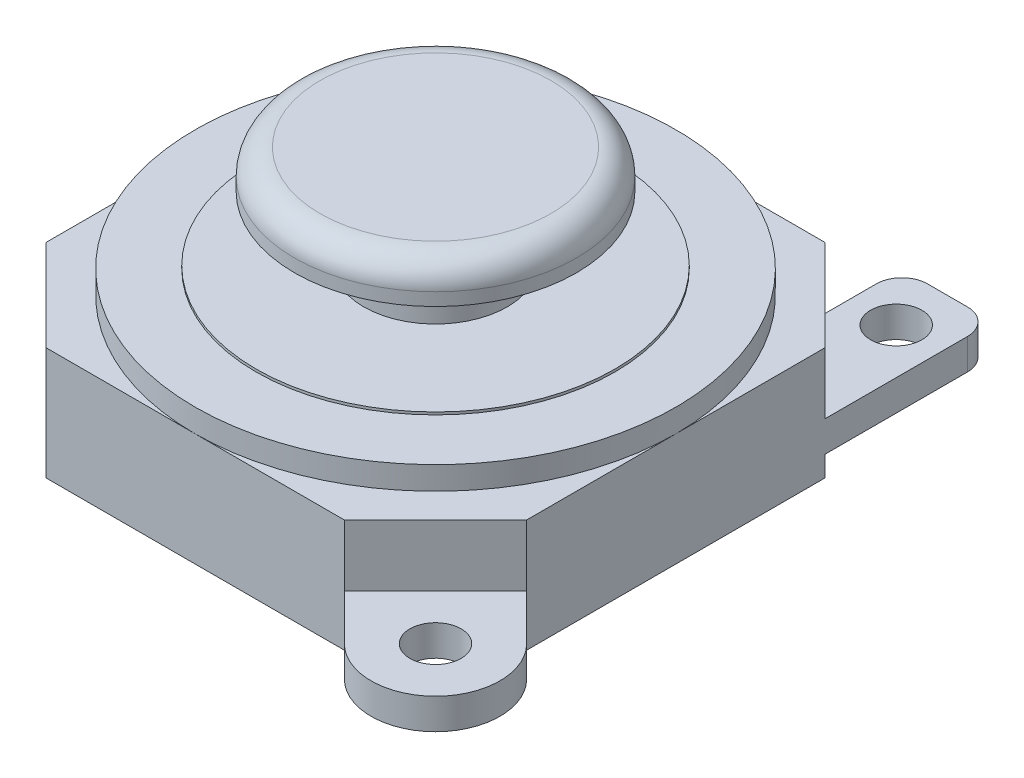
ISO-10303-21;
HEADER;
FILE_DESCRIPTION(('STEP AP214'),'2;1');
FILE_NAME('part.step','',(''),(''),'','','');
FILE_SCHEMA(('AUTOMOTIVE_DESIGN { 1 0 10303 214 1 1 1 1 }'));
ENDSEC;
DATA;
#1=APPLICATION_CONTEXT('core data for automotive mechanical design processes');
#2=APPLICATION_PROTOCOL_DEFINITION('international standard','automotive_design',2000,#1);
#3=PRODUCT_CONTEXT('',#1,'mechanical');
#4=PRODUCT('Part','Part','',(#3));
#5=PRODUCT_RELATED_PRODUCT_CATEGORY('part','',(#4));
#6=PRODUCT_DEFINITION_FORMATION('','',#4);
#7=PRODUCT_DEFINITION_CONTEXT('part definition',#1,'design');
#8=PRODUCT_DEFINITION('design','',#6,#7);
#9=PRODUCT_DEFINITION_SHAPE('','',#8);
#10=(LENGTH_UNIT() NAMED_UNIT(*) SI_UNIT(.MILLI.,.METRE.));
#11=(NAMED_UNIT(*) PLANE_ANGLE_UNIT() SI_UNIT($,.RADIAN.));
#12=(NAMED_UNIT(*) SI_UNIT($,.STERADIAN.) SOLID_ANGLE_UNIT());
#13=UNCERTAINTY_MEASURE_WITH_UNIT(LENGTH_MEASURE(1.E-05),#10,'distance_accuracy_value','');
#14=(GEOMETRIC_REPRESENTATION_CONTEXT(3) GLOBAL_UNCERTAINTY_ASSIGNED_CONTEXT((#13)) GLOBAL_UNIT_ASSIGNED_CONTEXT((#10,
#11,#12)) REPRESENTATION_CONTEXT('',''));
#15=CARTESIAN_POINT('',(0.,0.,0.));
#16=DIRECTION('',(0.,0.,1.));
#17=DIRECTION('',(1.,0.,0.));
#18=AXIS2_PLACEMENT_3D('',#15,#16,#17);
#19=CARTESIAN_POINT('',(-12.7622630211012,-78.4797185903092,-40.3475908086004));
#20=DIRECTION('',(-0.707106781186548,0.,0.707106781186547));
#21=DIRECTION('',(0.707106781186547,0.,0.707106781186548));
#22=AXIS2_PLACEMENT_3D('',#19,#20,#21);
#23=PLANE('',#22);
#24=DIRECTION('',(0.707106781186547,0.,0.707106781186548));
#25=VECTOR('',#24,1.);
#26=CARTESIAN_POINT('',(-9.2062630211012,-80.8797185903092,-36.7915908086004));
#27=LINE('',#26,#25);
#28=CARTESIAN_POINT('',(-12.7622630211012,-80.8797185903092,-40.3475908086004));
#29=VERTEX_POINT('',#28);
#30=CARTESIAN_POINT('',(-9.2062630211012,-80.8797185903092,-36.7915908086004));
#31=VERTEX_POINT('',#30);
#32=EDGE_CURVE('E623',#29,#31,#27,.T.);
#33=ORIENTED_EDGE('',*,*,#32,.F.);
#34=DIRECTION('',(0.,-1.,0.));
#35=VECTOR('',#34,1.);
#36=CARTESIAN_POINT('',(-12.7622630211012,-78.4797185903092,-40.3475908086004));
#37=LINE('',#36,#35);
#38=CARTESIAN_POINT('',(-12.7622630211012,-78.4797185903092,-40.3475908086004));
#39=VERTEX_POINT('',#38);
#40=EDGE_CURVE('E241',#39,#29,#37,.T.);
#41=ORIENTED_EDGE('',*,*,#40,.F.);
#42=DIRECTION('',(-0.707106781186547,0.,-0.707106781186548));
#43=VECTOR('',#42,1.);
#44=CARTESIAN_POINT('',(-12.7622630211012,-78.4797185903092,-40.3475908086004));
#45=LINE('',#44,#43);
#46=CARTESIAN_POINT('',(-9.2062630211012,-78.4797185903092,-36.7915908086004));
#47=VERTEX_POINT('',#46);
#48=EDGE_CURVE('E255',#47,#39,#45,.T.);
#49=ORIENTED_EDGE('',*,*,#48,.F.);
#50=DIRECTION('',(0.,-1.,0.));
#51=VECTOR('',#50,1.);
#52=CARTESIAN_POINT('',(-9.2062630211012,-78.4797185903092,-36.7915908086004));
#53=LINE('',#52,#51);
#54=EDGE_CURVE('E82',#47,#31,#53,.T.);
#55=ORIENTED_EDGE('',*,*,#54,.T.);
#56=EDGE_LOOP('',(#33,#41,#49,#55));
#57=FACE_BOUND('',#56,.T.);
#58=ADVANCED_FACE('F52',(#57),#23,.F.);
#59=DIRECTION('',(-0.707106781186547,0.,-0.707106781186548));
#60=VECTOR('',#59,1.);
#61=CARTESIAN_POINT('',(-9.2062630211012,-82.0797185903092,-36.7915908086004));
#62=LINE('',#61,#60);
#63=CARTESIAN_POINT('',(-9.2062630211012,-82.0797185903092,-36.7915908086004));
#64=VERTEX_POINT('',#63);
#65=CARTESIAN_POINT('',(-12.7622630211012,-82.0797185903092,-40.3475908086004));
#66=VERTEX_POINT('',#65);
#67=EDGE_CURVE('E73',#64,#66,#62,.T.);
#68=ORIENTED_EDGE('',*,*,#67,.F.);
#69=CARTESIAN_POINT('',(-9.2062630211012,-82.8797185903092,-36.7915908086004));
#70=VERTEX_POINT('',#69);
#71=EDGE_CURVE('E461',#64,#70,#53,.T.);
#72=ORIENTED_EDGE('',*,*,#71,.T.);
#73=DIRECTION('',(-0.707106781186547,0.,-0.707106781186548));
#74=VECTOR('',#73,1.);
#75=CARTESIAN_POINT('',(-12.7622630211012,-82.8797185903092,-40.3475908086004));
#76=LINE('',#75,#74);
#77=CARTESIAN_POINT('',(-12.7622630211012,-82.8797185903092,-40.3475908086004));
#78=VERTEX_POINT('',#77);
#79=EDGE_CURVE('E252',#70,#78,#76,.T.);
#80=ORIENTED_EDGE('',*,*,#79,.T.);
#81=EDGE_CURVE('E237',#66,#78,#37,.T.);
#82=ORIENTED_EDGE('',*,*,#81,.F.);
#83=EDGE_LOOP('',(#68,#72,#80,#82));
#84=FACE_BOUND('',#83,.T.);
#85=ADVANCED_FACE('F250',(#84),#23,.F.);
#86=CARTESIAN_POINT('',(-12.7622630211012,-78.4797185903092,-21.5975908086004));
#87=DIRECTION('',(-0.707106781186548,0.,-0.707106781186547));
#88=DIRECTION('',(-0.707106781186547,0.,0.707106781186548));
#89=AXIS2_PLACEMENT_3D('',#86,#87,#88);
#90=PLANE('',#89);
#91=DIRECTION('',(-0.707106781186547,0.,0.707106781186548));
#92=VECTOR('',#91,1.);
#93=CARTESIAN_POINT('',(-17.1799269148508,-80.8797185903092,-17.1799269148508));
#94=LINE('',#93,#92);
#95=CARTESIAN_POINT('',(-9.2062630211012,-80.8797185903092,-25.1535908086004));
#96=VERTEX_POINT('',#95);
#97=CARTESIAN_POINT('',(-12.7622630211012,-80.8797185903092,-21.5975908086004));
#98=VERTEX_POINT('',#97);
#99=EDGE_CURVE('E326',#96,#98,#94,.T.);
#100=ORIENTED_EDGE('',*,*,#99,.F.);
#101=DIRECTION('',(0.,-1.,0.));
#102=VECTOR('',#101,1.);
#103=CARTESIAN_POINT('',(-9.2062630211012,-78.4797185903092,-25.1535908086004));
#104=LINE('',#103,#102);
#105=CARTESIAN_POINT('',(-9.2062630211012,-78.4797185903092,-25.1535908086004));
#106=VERTEX_POINT('',#105);
#107=EDGE_CURVE('E584',#106,#96,#104,.T.);
#108=ORIENTED_EDGE('',*,*,#107,.F.);
#109=DIRECTION('',(0.707106781186547,0.,-0.707106781186548));
#110=VECTOR('',#109,1.);
#111=CARTESIAN_POINT('',(-12.7622630211012,-78.4797185903092,-21.5975908086004));
#112=LINE('',#111,#110);
#113=CARTESIAN_POINT('',(-12.7622630211012,-78.4797185903092,-21.5975908086004));
#114=VERTEX_POINT('',#113);
#115=EDGE_CURVE('E417',#114,#106,#112,.T.);
#116=ORIENTED_EDGE('',*,*,#115,.F.);
#117=DIRECTION('',(0.,-1.,0.));
#118=VECTOR('',#117,1.);
#119=CARTESIAN_POINT('',(-12.7622630211012,-78.4797185903092,-21.5975908086004));
#120=LINE('',#119,#118);
#121=EDGE_CURVE('E599',#114,#98,#120,.T.);
#122=ORIENTED_EDGE('',*,*,#121,.T.);
#123=EDGE_LOOP('',(#100,#108,#116,#122));
#124=FACE_BOUND('',#123,.T.);
#125=ADVANCED_FACE('F501',(#124),#90,.F.);
#126=CARTESIAN_POINT('',(0.,-78.4797185903092,0.));
#127=DIRECTION('',(0.,-1.,0.));
#128=DIRECTION('',(0.,0.,-1.));
#129=AXIS2_PLACEMENT_3D('',#126,#127,#128);
#130=PLANE('',#129);
#131=CARTESIAN_POINT('',(-18.5812630211012,-78.4797185903092,-30.9725908086004));
#132=DIRECTION('',(0.,1.,0.));
#133=DIRECTION('',(0.,0.,1.));
#134=AXIS2_PLACEMENT_3D('',#131,#132,#133);
#135=CIRCLE('',#134,9.375);
#136=CARTESIAN_POINT('',(-18.5812630211012,-78.4797185903092,-21.5975908086004));
#137=VERTEX_POINT('',#136);
#138=CARTESIAN_POINT('',(-9.2062630211012,-78.4797185903092,-30.9725908086004));
#139=VERTEX_POINT('',#138);
#140=EDGE_CURVE('E383',#137,#139,#135,.T.);
#141=ORIENTED_EDGE('',*,*,#140,.F.);
#142=DIRECTION('',(1.,0.,0.));
#143=VECTOR('',#142,1.);
#144=CARTESIAN_POINT('',(-24.4002630211012,-78.4797185903092,-21.5975908086004));
#145=LINE('',#144,#143);
#146=EDGE_CURVE('E413',#137,#114,#145,.T.);
#147=ORIENTED_EDGE('',*,*,#146,.T.);
#148=ORIENTED_EDGE('',*,*,#115,.T.);
#149=DIRECTION('',(0.,0.,-1.));
#150=VECTOR('',#149,1.);
#151=CARTESIAN_POINT('',(-9.2062630211012,-78.4797185903092,-36.7915908086004));
#152=LINE('',#151,#150);
#153=EDGE_CURVE('E421',#106,#139,#152,.T.);
#154=ORIENTED_EDGE('',*,*,#153,.T.);
#155=EDGE_LOOP('',(#141,#147,#148,#154));
#156=FACE_BOUND('',#155,.T.);
#157=ADVANCED_FACE('F540',(#156),#130,.F.);
#158=CARTESIAN_POINT('',(-18.5812630211012,-78.4797185903092,-40.3475908086004));
#159=VERTEX_POINT('',#158);
#160=EDGE_CURVE('E395',#139,#159,#135,.T.);
#161=ORIENTED_EDGE('',*,*,#160,.F.);
#162=EDGE_CURVE('E420',#139,#47,#152,.T.);
#163=ORIENTED_EDGE('',*,*,#162,.T.);
#164=ORIENTED_EDGE('',*,*,#48,.T.);
#165=DIRECTION('',(-1.,0.,0.));
#166=VECTOR('',#165,1.);
#167=CARTESIAN_POINT('',(-24.4002630211012,-78.4797185903092,-40.3475908086004));
#168=LINE('',#167,#166);
#169=EDGE_CURVE('E397',#39,#159,#168,.T.);
#170=ORIENTED_EDGE('',*,*,#169,.T.);
#171=EDGE_LOOP('',(#161,#163,#164,#170));
#172=FACE_BOUND('',#171,.T.);
#173=ADVANCED_FACE('F535',(#172),#130,.F.);
#174=CARTESIAN_POINT('',(-27.9562630211012,-78.4797185903092,-30.9725908086004));
#175=VERTEX_POINT('',#174);
#176=EDGE_CURVE('E564',#159,#175,#135,.T.);
#177=ORIENTED_EDGE('',*,*,#176,.F.);
#178=CARTESIAN_POINT('',(-24.4002630211012,-78.4797185903092,-40.3475908086004));
#179=VERTEX_POINT('',#178);
#180=EDGE_CURVE('E402',#159,#179,#168,.T.);
#181=ORIENTED_EDGE('',*,*,#180,.T.);
#182=DIRECTION('',(-0.707106781186547,0.,0.707106781186548));
#183=VECTOR('',#182,1.);
#184=CARTESIAN_POINT('',(-27.9562630211012,-78.4797185903092,-36.7915908086004));
#185=LINE('',#184,#183);
#186=CARTESIAN_POINT('',(-27.9562630211012,-78.4797185903092,-36.7915908086004));
#187=VERTEX_POINT('',#186);
#188=EDGE_CURVE('E401',#179,#187,#185,.T.);
#189=ORIENTED_EDGE('',*,*,#188,.T.);
#190=DIRECTION('',(0.,0.,1.));
#191=VECTOR('',#190,1.);
#192=CARTESIAN_POINT('',(-27.9562630211012,-78.4797185903092,-36.7915908086004));
#193=LINE('',#192,#191);
#194=EDGE_CURVE('E406',#187,#175,#193,.T.);
#195=ORIENTED_EDGE('',*,*,#194,.T.);
#196=EDGE_LOOP('',(#177,#181,#189,#195));
#197=FACE_BOUND('',#196,.T.);
#198=ADVANCED_FACE('F531',(#197),#130,.F.);
#199=CARTESIAN_POINT('',(-24.4002630211012,-78.4797185903092,-40.3475908086004));
#200=DIRECTION('',(0.,0.,1.));
#201=DIRECTION('',(1.,0.,0.));
#202=AXIS2_PLACEMENT_3D('',#199,#200,#201);
#203=PLANE('',#202);
#204=DIRECTION('',(-1.,0.,0.));
#205=VECTOR('',#204,1.);
#206=CARTESIAN_POINT('',(-24.4002630211012,-82.8797185903092,-40.3475908086004));
#207=LINE('',#206,#205);
#208=CARTESIAN_POINT('',(-24.4002630211012,-82.8797185903092,-40.3475908086004));
#209=VERTEX_POINT('',#208);
#210=EDGE_CURVE('E391',#78,#209,#207,.T.);
#211=ORIENTED_EDGE('',*,*,#210,.T.);
#212=DIRECTION('',(0.,-1.,0.));
#213=VECTOR('',#212,1.);
#214=CARTESIAN_POINT('',(-24.4002630211012,-78.4797185903092,-40.3475908086004));
#215=LINE('',#214,#213);
#216=EDGE_CURVE('E567',#179,#209,#215,.T.);
#217=ORIENTED_EDGE('',*,*,#216,.F.);
#218=ORIENTED_EDGE('',*,*,#180,.F.);
#219=ORIENTED_EDGE('',*,*,#169,.F.);
#220=ORIENTED_EDGE('',*,*,#40,.T.);
#221=DIRECTION('',(0.,-1.,0.));
#222=VECTOR('',#221,1.);
#223=CARTESIAN_POINT('',(-12.7622630211012,-73.4214163706348,-40.3475908086004));
#224=LINE('',#223,#222);
#225=EDGE_CURVE('E234',#29,#66,#224,.T.);
#226=ORIENTED_EDGE('',*,*,#225,.T.);
#227=ORIENTED_EDGE('',*,*,#81,.T.);
#228=EDGE_LOOP('',(#211,#217,#218,#219,#220,#226,#227));
#229=FACE_BOUND('',#228,.T.);
#230=ADVANCED_FACE('F236',(#229),#203,.F.);
#231=CARTESIAN_POINT('',(-27.9562630211012,-78.4797185903092,-36.7915908086004));
#232=DIRECTION('',(0.707106781186548,0.,0.707106781186547));
#233=DIRECTION('',(0.707106781186547,0.,-0.707106781186548));
#234=AXIS2_PLACEMENT_3D('',#231,#232,#233);
#235=PLANE('',#234);
#236=DIRECTION('',(-0.707106781186547,0.,0.707106781186548));
#237=VECTOR('',#236,1.);
#238=CARTESIAN_POINT('',(-27.9562630211012,-82.8797185903092,-36.7915908086004));
#239=LINE('',#238,#237);
#240=CARTESIAN_POINT('',(-27.9562630211012,-82.8797185903092,-36.7915908086004));
#241=VERTEX_POINT('',#240);
#242=EDGE_CURVE('E429',#209,#241,#239,.T.);
#243=ORIENTED_EDGE('',*,*,#242,.T.);
#244=DIRECTION('',(0.,-1.,0.));
#245=VECTOR('',#244,1.);
#246=CARTESIAN_POINT('',(-27.9562630211012,-78.4797185903092,-36.7915908086004));
#247=LINE('',#246,#245);
#248=EDGE_CURVE('E571',#187,#241,#247,.T.);
#249=ORIENTED_EDGE('',*,*,#248,.F.);
#250=ORIENTED_EDGE('',*,*,#188,.F.);
#251=ORIENTED_EDGE('',*,*,#216,.T.);
#252=EDGE_LOOP('',(#243,#249,#250,#251));
#253=FACE_BOUND('',#252,.T.);
#254=ADVANCED_FACE('F526',(#253),#235,.F.);
#255=CARTESIAN_POINT('',(-27.9562630211012,-78.4797185903092,-36.7915908086004));
#256=DIRECTION('',(1.,0.,0.));
#257=DIRECTION('',(0.,0.,-1.));
#258=AXIS2_PLACEMENT_3D('',#255,#256,#257);
#259=PLANE('',#258);
#260=DIRECTION('',(0.,0.,1.));
#261=VECTOR('',#260,1.);
#262=CARTESIAN_POINT('',(-27.9562630211012,-82.8797185903092,-36.7915908086004));
#263=LINE('',#262,#261);
#264=CARTESIAN_POINT('',(-27.9562630211012,-82.8797185903092,-25.1535908086004));
#265=VERTEX_POINT('',#264);
#266=EDGE_CURVE('E432',#241,#265,#263,.T.);
#267=ORIENTED_EDGE('',*,*,#266,.T.);
#268=DIRECTION('',(0.,-1.,0.));
#269=VECTOR('',#268,1.);
#270=CARTESIAN_POINT('',(-27.9562630211012,-78.4797185903092,-25.1535908086004));
#271=LINE('',#270,#269);
#272=CARTESIAN_POINT('',(-27.9562630211012,-78.4797185903092,-25.1535908086004));
#273=VERTEX_POINT('',#272);
#274=EDGE_CURVE('E577',#273,#265,#271,.T.);
#275=ORIENTED_EDGE('',*,*,#274,.F.);
#276=EDGE_CURVE('E405',#175,#273,#193,.T.);
#277=ORIENTED_EDGE('',*,*,#276,.F.);
#278=ORIENTED_EDGE('',*,*,#194,.F.);
#279=ORIENTED_EDGE('',*,*,#248,.T.);
#280=EDGE_LOOP('',(#267,#275,#277,#278,#279));
#281=FACE_BOUND('',#280,.T.);
#282=ADVANCED_FACE('F522',(#281),#259,.F.);
#283=CARTESIAN_POINT('',(-27.9562630211012,-78.4797185903092,-25.1535908086004));
#284=DIRECTION('',(0.707106781186548,0.,-0.707106781186548));
#285=DIRECTION('',(-0.707106781186548,0.,-0.707106781186548));
#286=AXIS2_PLACEMENT_3D('',#283,#284,#285);
#287=PLANE('',#286);
#288=DIRECTION('',(0.707106781186547,0.,0.707106781186547));
#289=VECTOR('',#288,1.);
#290=CARTESIAN_POINT('',(-27.9562630211012,-82.8797185903092,-25.1535908086004));
#291=LINE('',#290,#289);
#292=CARTESIAN_POINT('',(-24.4002630211012,-82.8797185903092,-21.5975908086004));
#293=VERTEX_POINT('',#292);
#294=EDGE_CURVE('E435',#265,#293,#291,.T.);
#295=ORIENTED_EDGE('',*,*,#294,.T.);
#296=DIRECTION('',(0.,-1.,0.));
#297=VECTOR('',#296,1.);
#298=CARTESIAN_POINT('',(-24.4002630211012,-78.4797185903092,-21.5975908086004));
#299=LINE('',#298,#297);
#300=CARTESIAN_POINT('',(-24.4002630211012,-78.4797185903092,-21.5975908086004));
#301=VERTEX_POINT('',#300);
#302=EDGE_CURVE('E596',#301,#293,#299,.T.);
#303=ORIENTED_EDGE('',*,*,#302,.F.);
#304=DIRECTION('',(0.707106781186547,0.,0.707106781186547));
#305=VECTOR('',#304,1.);
#306=CARTESIAN_POINT('',(-27.9562630211012,-78.4797185903092,-25.1535908086004));
#307=LINE('',#306,#305);
#308=EDGE_CURVE('E410',#273,#301,#307,.T.);
#309=ORIENTED_EDGE('',*,*,#308,.F.);
#310=ORIENTED_EDGE('',*,*,#274,.T.);
#311=EDGE_LOOP('',(#295,#303,#309,#310));
#312=FACE_BOUND('',#311,.T.);
#313=ADVANCED_FACE('F518',(#312),#287,.F.);
#314=CARTESIAN_POINT('',(-24.4002630211012,-78.4797185903092,-21.5975908086004));
#315=DIRECTION('',(0.,0.,-1.));
#316=DIRECTION('',(-1.,0.,0.));
#317=AXIS2_PLACEMENT_3D('',#314,#315,#316);
#318=PLANE('',#317);
#319=DIRECTION('',(1.,0.,0.));
#320=VECTOR('',#319,1.);
#321=CARTESIAN_POINT('',(-24.4002630211012,-82.8797185903092,-21.5975908086004));
#322=LINE('',#321,#320);
#323=CARTESIAN_POINT('',(-12.7622630211012,-82.8797185903092,-21.5975908086004));
#324=VERTEX_POINT('',#323);
#325=EDGE_CURVE('E438',#293,#324,#322,.T.);
#326=ORIENTED_EDGE('',*,*,#325,.T.);
#327=CARTESIAN_POINT('',(-12.7622630211012,-82.0797185903092,-21.5975908086004));
#328=VERTEX_POINT('',#327);
#329=EDGE_CURVE('E588',#328,#324,#120,.T.);
#330=ORIENTED_EDGE('',*,*,#329,.F.);
#331=DIRECTION('',(0.,-1.,0.));
#332=VECTOR('',#331,1.);
#333=CARTESIAN_POINT('',(-12.7622630211012,-80.8797185903092,-21.5975908086004));
#334=LINE('',#333,#332);
#335=EDGE_CURVE('E334',#98,#328,#334,.T.);
#336=ORIENTED_EDGE('',*,*,#335,.F.);
#337=ORIENTED_EDGE('',*,*,#121,.F.);
#338=ORIENTED_EDGE('',*,*,#146,.F.);
#339=EDGE_CURVE('E414',#301,#137,#145,.T.);
#340=ORIENTED_EDGE('',*,*,#339,.F.);
#341=ORIENTED_EDGE('',*,*,#302,.T.);
#342=EDGE_LOOP('',(#326,#330,#336,#337,#338,#340,#341));
#343=FACE_BOUND('',#342,.T.);
#344=ADVANCED_FACE('F514',(#343),#318,.F.);
#345=CARTESIAN_POINT('',(-9.2062630211012,-82.0797185903092,-25.1535908086004));
#346=VERTEX_POINT('',#345);
#347=CARTESIAN_POINT('',(-9.2062630211012,-82.8797185903092,-25.1535908086004));
#348=VERTEX_POINT('',#347);
#349=EDGE_CURVE('E589',#346,#348,#104,.T.);
#350=ORIENTED_EDGE('',*,*,#349,.F.);
#351=DIRECTION('',(-0.707106781186547,0.,0.707106781186548));
#352=VECTOR('',#351,1.);
#353=CARTESIAN_POINT('',(-17.1799269148508,-82.0797185903092,-17.1799269148508));
#354=LINE('',#353,#352);
#355=EDGE_CURVE('E353',#346,#328,#354,.T.);
#356=ORIENTED_EDGE('',*,*,#355,.T.);
#357=ORIENTED_EDGE('',*,*,#329,.T.);
#358=DIRECTION('',(0.707106781186547,0.,-0.707106781186548));
#359=VECTOR('',#358,1.);
#360=CARTESIAN_POINT('',(-12.7622630211012,-82.8797185903092,-21.5975908086004));
#361=LINE('',#360,#359);
#362=EDGE_CURVE('E442',#324,#348,#361,.T.);
#363=ORIENTED_EDGE('',*,*,#362,.T.);
#364=EDGE_LOOP('',(#350,#356,#357,#363));
#365=FACE_BOUND('',#364,.T.);
#366=ADVANCED_FACE('F510',(#365),#90,.F.);
#367=CARTESIAN_POINT('',(-9.2062630211012,-78.4797185903092,-36.7915908086004));
#368=DIRECTION('',(-1.,0.,0.));
#369=DIRECTION('',(0.,0.,1.));
#370=AXIS2_PLACEMENT_3D('',#367,#368,#369);
#371=PLANE('',#370);
#372=DIRECTION('',(0.,0.,-1.));
#373=VECTOR('',#372,1.);
#374=CARTESIAN_POINT('',(-9.2062630211012,-82.8797185903092,-36.7915908086004));
#375=LINE('',#374,#373);
#376=EDGE_CURVE('E446',#348,#70,#375,.T.);
#377=ORIENTED_EDGE('',*,*,#376,.T.);
#378=ORIENTED_EDGE('',*,*,#71,.F.);
#379=DIRECTION('',(0.,0.,1.));
#380=VECTOR('',#379,1.);
#381=CARTESIAN_POINT('',(-9.2062630211012,-82.0797185903092,-36.7915908086004));
#382=LINE('',#381,#380);
#383=CARTESIAN_POINT('',(-9.2062630211012,-82.0797185903092,-42.3475908086004));
#384=VERTEX_POINT('',#383);
#385=EDGE_CURVE('E248',#384,#64,#382,.T.);
#386=ORIENTED_EDGE('',*,*,#385,.F.);
#387=DIRECTION('',(0.,-1.,0.));
#388=VECTOR('',#387,1.);
#389=CARTESIAN_POINT('',(-9.2062630211012,-73.4214163706348,-42.3475908086004));
#390=LINE('',#389,#388);
#391=CARTESIAN_POINT('',(-9.2062630211012,-80.8797185903092,-42.3475908086004));
#392=VERTEX_POINT('',#391);
#393=EDGE_CURVE('E294',#392,#384,#390,.T.);
#394=ORIENTED_EDGE('',*,*,#393,.F.);
#395=DIRECTION('',(0.,0.,-1.));
#396=VECTOR('',#395,1.);
#397=CARTESIAN_POINT('',(-9.2062630211012,-80.8797185903092,-36.7915908086004));
#398=LINE('',#397,#396);
#399=EDGE_CURVE('E621',#31,#392,#398,.T.);
#400=ORIENTED_EDGE('',*,*,#399,.F.);
#401=ORIENTED_EDGE('',*,*,#54,.F.);
#402=ORIENTED_EDGE('',*,*,#162,.F.);
#403=ORIENTED_EDGE('',*,*,#153,.F.);
#404=ORIENTED_EDGE('',*,*,#107,.T.);
#405=DIRECTION('',(0.,-1.,0.));
#406=VECTOR('',#405,1.);
#407=CARTESIAN_POINT('',(-9.2062630211012,-80.8797185903092,-25.1535908086004));
#408=LINE('',#407,#406);
#409=EDGE_CURVE('E338',#96,#346,#408,.T.);
#410=ORIENTED_EDGE('',*,*,#409,.T.);
#411=ORIENTED_EDGE('',*,*,#349,.T.);
#412=EDGE_LOOP('',(#377,#378,#386,#394,#400,#401,#402,#403,#404,#410,#411));
#413=FACE_BOUND('',#412,.T.);
#414=ADVANCED_FACE('F506',(#413),#371,.F.);
#415=EDGE_CURVE('E396',#175,#137,#135,.T.);
#416=ORIENTED_EDGE('',*,*,#415,.F.);
#417=ORIENTED_EDGE('',*,*,#276,.T.);
#418=ORIENTED_EDGE('',*,*,#308,.T.);
#419=ORIENTED_EDGE('',*,*,#339,.T.);
#420=EDGE_LOOP('',(#416,#417,#418,#419));
#421=FACE_BOUND('',#420,.T.);
#422=ADVANCED_FACE('F509',(#421),#130,.F.);
#423=CARTESIAN_POINT('',(0.,-82.8797185903092,0.));
#424=DIRECTION('',(0.,-1.,0.));
#425=DIRECTION('',(0.,0.,-1.));
#426=AXIS2_PLACEMENT_3D('',#423,#424,#425);
#427=PLANE('',#426);
#428=ORIENTED_EDGE('',*,*,#210,.F.);
#429=ORIENTED_EDGE('',*,*,#79,.F.);
#430=ORIENTED_EDGE('',*,*,#376,.F.);
#431=ORIENTED_EDGE('',*,*,#362,.F.);
#432=ORIENTED_EDGE('',*,*,#325,.F.);
#433=ORIENTED_EDGE('',*,*,#294,.F.);
#434=ORIENTED_EDGE('',*,*,#266,.F.);
#435=ORIENTED_EDGE('',*,*,#242,.F.);
#436=EDGE_LOOP('',(#428,#429,#430,#431,#432,#433,#434,#435));
#437=FACE_BOUND('',#436,.T.);
#438=ADVANCED_FACE('F504',(#437),#427,.T.);
#439=CARTESIAN_POINT('',(-18.5812630211012,-77.5797185903092,-30.9725908086004));
#440=DIRECTION('',(0.,-1.,0.));
#441=DIRECTION('',(0.,0.,-1.));
#442=AXIS2_PLACEMENT_3D('',#439,#440,#441);
#443=CYLINDRICAL_SURFACE('',#442,9.375);
#444=CARTESIAN_POINT('',(-18.5812630211012,-77.5797185903092,-30.9725908086004));
#445=DIRECTION('',(0.,1.,0.));
#446=DIRECTION('',(0.,0.,1.));
#447=AXIS2_PLACEMENT_3D('',#444,#445,#446);
#448=CIRCLE('',#447,9.375);
#449=CARTESIAN_POINT('',(-18.5812630211012,-77.5797185903092,-21.5975908086004));
#450=VERTEX_POINT('',#449);
#451=EDGE_CURVE('E387',#450,#450,#448,.T.);
#452=ORIENTED_EDGE('',*,*,#451,.F.);
#453=EDGE_LOOP('',(#452));
#454=FACE_BOUND('',#453,.T.);
#455=ORIENTED_EDGE('',*,*,#140,.T.);
#456=ORIENTED_EDGE('',*,*,#160,.T.);
#457=ORIENTED_EDGE('',*,*,#176,.T.);
#458=ORIENTED_EDGE('',*,*,#415,.T.);
#459=EDGE_LOOP('',(#455,#456,#457,#458));
#460=FACE_BOUND('',#459,.T.);
#461=ADVANCED_FACE('F548',(#454,#460),#443,.T.);
#462=CARTESIAN_POINT('',(-18.5812630211012,-77.5797185903092,-30.9725908086004));
#463=DIRECTION('',(0.,1.,0.));
#464=DIRECTION('',(0.,0.,1.));
#465=AXIS2_PLACEMENT_3D('',#462,#463,#464);
#466=PLANE('',#465);
#467=CARTESIAN_POINT('',(-18.5812630211012,-77.5797185903092,-30.9725908086004));
#468=DIRECTION('',(0.,1.,0.));
#469=DIRECTION('',(0.,0.,1.));
#470=AXIS2_PLACEMENT_3D('',#467,#468,#469);
#471=CIRCLE('',#470,7.);
#472=CARTESIAN_POINT('',(-18.5812630211012,-77.5797185903092,-23.9725908086004));
#473=VERTEX_POINT('',#472);
#474=EDGE_CURVE('E375',#473,#473,#471,.T.);
#475=ORIENTED_EDGE('',*,*,#474,.F.);
#476=EDGE_LOOP('',(#475));
#477=FACE_BOUND('',#476,.T.);
#478=ORIENTED_EDGE('',*,*,#451,.T.);
#479=EDGE_LOOP('',(#478));
#480=FACE_BOUND('',#479,.T.);
#481=ADVANCED_FACE('F715',(#477,#480),#466,.T.);
#482=CARTESIAN_POINT('',(-18.5812630211012,-77.4797185903092,-30.9725908086004));
#483=DIRECTION('',(0.,-1.,0.));
#484=DIRECTION('',(0.,0.,-1.));
#485=AXIS2_PLACEMENT_3D('',#482,#483,#484);
#486=CYLINDRICAL_SURFACE('',#485,7.);
#487=CARTESIAN_POINT('',(-18.5812630211012,-77.4797185903092,-30.9725908086004));
#488=DIRECTION('',(0.,1.,0.));
#489=DIRECTION('',(0.,0.,1.));
#490=AXIS2_PLACEMENT_3D('',#487,#488,#489);
#491=CIRCLE('',#490,7.);
#492=CARTESIAN_POINT('',(-18.5812630211012,-77.4797185903092,-23.9725908086004));
#493=VERTEX_POINT('',#492);
#494=EDGE_CURVE('E379',#493,#493,#491,.T.);
#495=ORIENTED_EDGE('',*,*,#494,.F.);
#496=EDGE_LOOP('',(#495));
#497=FACE_BOUND('',#496,.T.);
#498=ORIENTED_EDGE('',*,*,#474,.T.);
#499=EDGE_LOOP('',(#498));
#500=FACE_BOUND('',#499,.T.);
#501=ADVANCED_FACE('F711',(#497,#500),#486,.T.);
#502=CARTESIAN_POINT('',(-18.5812630211012,-77.4797185903092,-30.9725908086004));
#503=DIRECTION('',(0.,1.,0.));
#504=DIRECTION('',(0.,0.,1.));
#505=AXIS2_PLACEMENT_3D('',#502,#503,#504);
#506=PLANE('',#505);
#507=CARTESIAN_POINT('',(-18.5812630211012,-77.4797185903092,-30.9725908086004));
#508=DIRECTION('',(0.,1.,0.));
#509=DIRECTION('',(0.,0.,1.));
#510=AXIS2_PLACEMENT_3D('',#507,#508,#509);
#511=CIRCLE('',#510,2.8);
#512=CARTESIAN_POINT('',(-18.5812630211012,-77.4797185903092,-28.1725908086004));
#513=VERTEX_POINT('',#512);
#514=EDGE_CURVE('E370',#513,#513,#511,.T.);
#515=ORIENTED_EDGE('',*,*,#514,.F.);
#516=EDGE_LOOP('',(#515));
#517=FACE_BOUND('',#516,.T.);
#518=ORIENTED_EDGE('',*,*,#494,.T.);
#519=EDGE_LOOP('',(#518));
#520=FACE_BOUND('',#519,.T.);
#521=ADVANCED_FACE('F707',(#517,#520),#506,.T.);
#522=CARTESIAN_POINT('',(-18.5812630211012,-74.9797185903092,-30.9725908086004));
#523=DIRECTION('',(0.,-1.,0.));
#524=DIRECTION('',(0.,0.,-1.));
#525=AXIS2_PLACEMENT_3D('',#522,#523,#524);
#526=CYLINDRICAL_SURFACE('',#525,2.8);
#527=CARTESIAN_POINT('',(-18.5812630211012,-74.9797185903092,-30.9725908086004));
#528=DIRECTION('',(0.,1.,0.));
#529=DIRECTION('',(0.,0.,1.));
#530=AXIS2_PLACEMENT_3D('',#527,#528,#529);
#531=CIRCLE('',#530,2.8);
#532=CARTESIAN_POINT('',(-18.5812630211012,-74.9797185903092,-28.1725908086004));
#533=VERTEX_POINT('',#532);
#534=EDGE_CURVE('E371',#533,#533,#531,.T.);
#535=ORIENTED_EDGE('',*,*,#534,.F.);
#536=EDGE_LOOP('',(#535));
#537=FACE_BOUND('',#536,.T.);
#538=ORIENTED_EDGE('',*,*,#514,.T.);
#539=EDGE_LOOP('',(#538));
#540=FACE_BOUND('',#539,.T.);
#541=ADVANCED_FACE('F703',(#537,#540),#526,.T.);
#542=CARTESIAN_POINT('',(-18.5812630211012,-73.4797185903092,-30.9725908086004));
#543=DIRECTION('',(0.,-1.,0.));
#544=DIRECTION('',(0.,0.,-1.));
#545=AXIS2_PLACEMENT_3D('',#542,#543,#544);
#546=CYLINDRICAL_SURFACE('',#545,5.5);
#547=CARTESIAN_POINT('',(-18.5812630211012,-74.4797185903092,-30.9725908086004));
#548=DIRECTION('',(0.,1.,0.));
#549=DIRECTION('',(0.,0.,1.));
#550=AXIS2_PLACEMENT_3D('',#547,#548,#549);
#551=CIRCLE('',#550,5.5);
#552=CARTESIAN_POINT('',(-18.5812630211012,-74.4797185903092,-25.4725908086004));
#553=VERTEX_POINT('',#552);
#554=EDGE_CURVE('E13',#553,#553,#551,.F.);
#555=ORIENTED_EDGE('',*,*,#554,.T.);
#556=EDGE_LOOP('',(#555));
#557=FACE_BOUND('',#556,.T.);
#558=CARTESIAN_POINT('',(-18.5812630211012,-74.9797185903092,-30.9725908086004));
#559=DIRECTION('',(0.,1.,0.));
#560=DIRECTION('',(0.,0.,1.));
#561=AXIS2_PLACEMENT_3D('',#558,#559,#560);
#562=CIRCLE('',#561,5.5);
#563=CARTESIAN_POINT('',(-18.5812630211012,-74.9797185903092,-25.4725908086004));
#564=VERTEX_POINT('',#563);
#565=EDGE_CURVE('E364',#564,#564,#562,.T.);
#566=ORIENTED_EDGE('',*,*,#565,.T.);
#567=EDGE_LOOP('',(#566));
#568=FACE_BOUND('',#567,.T.);
#569=ADVANCED_FACE('F696',(#557,#568),#546,.T.);
#570=CARTESIAN_POINT('',(-18.5812630211012,-73.4797185903092,-30.9725908086004));
#571=DIRECTION('',(0.,1.,0.));
#572=DIRECTION('',(0.,0.,1.));
#573=AXIS2_PLACEMENT_3D('',#570,#571,#572);
#574=PLANE('',#573);
#575=CARTESIAN_POINT('',(-18.5812630211012,-73.4797185903092,-30.9725908086004));
#576=DIRECTION('',(0.,1.,0.));
#577=DIRECTION('',(0.,0.,1.));
#578=AXIS2_PLACEMENT_3D('',#575,#576,#577);
#579=CIRCLE('',#578,4.5);
#580=CARTESIAN_POINT('',(-18.5812630211012,-73.4797185903092,-26.4725908086004));
#581=VERTEX_POINT('',#580);
#582=EDGE_CURVE('E62',#581,#581,#579,.T.);
#583=ORIENTED_EDGE('',*,*,#582,.T.);
#584=EDGE_LOOP('',(#583));
#585=FACE_BOUND('',#584,.T.);
#586=ADVANCED_FACE('F692',(#585),#574,.T.);
#587=CARTESIAN_POINT('',(-18.5812630211012,-74.9797185903092,-30.9725908086004));
#588=DIRECTION('',(0.,1.,0.));
#589=DIRECTION('',(0.,0.,1.));
#590=AXIS2_PLACEMENT_3D('',#587,#588,#589);
#591=PLANE('',#590);
#592=ORIENTED_EDGE('',*,*,#534,.T.);
#593=EDGE_LOOP('',(#592));
#594=FACE_BOUND('',#593,.T.);
#595=ORIENTED_EDGE('',*,*,#565,.F.);
#596=EDGE_LOOP('',(#595));
#597=FACE_BOUND('',#596,.T.);
#598=ADVANCED_FACE('F695',(#594,#597),#591,.F.);
#599=CARTESIAN_POINT('',(-18.5812630211012,-74.4797185903092,-30.9725908086004));
#600=DIRECTION('',(0.,1.,0.));
#601=DIRECTION('',(0.,0.,1.));
#602=AXIS2_PLACEMENT_3D('',#599,#600,#601);
#603=TOROIDAL_SURFACE('',#602,4.5,1.);
#604=ORIENTED_EDGE('',*,*,#554,.F.);
#605=EDGE_LOOP('',(#604));
#606=FACE_BOUND('',#605,.T.);
#607=ORIENTED_EDGE('',*,*,#582,.F.);
#608=EDGE_LOOP('',(#607));
#609=FACE_BOUND('',#608,.T.);
#610=ADVANCED_FACE('F54',(#606,#609),#603,.T.);
#611=CARTESIAN_POINT('',(-9.2062630211012,-80.8797185903092,-21.5975908086004));
#612=DIRECTION('',(0.,-1.,0.));
#613=DIRECTION('',(0.,0.,-1.));
#614=AXIS2_PLACEMENT_3D('',#611,#612,#613);
#615=CYLINDRICAL_SURFACE('',#614,2.51447171389937);
#616=CARTESIAN_POINT('',(-9.2062630211012,-82.0797185903092,-21.5975908086004));
#617=DIRECTION('',(0.,-1.,0.));
#618=DIRECTION('',(0.,0.,-1.));
#619=AXIS2_PLACEMENT_3D('',#616,#617,#618);
#620=CIRCLE('',#619,2.51447171389937);
#621=CARTESIAN_POINT('',(-7.42826302110119,-82.0797185903092,-23.3755908086004));
#622=VERTEX_POINT('',#621);
#623=CARTESIAN_POINT('',(-10.9842630211012,-82.0797185903092,-19.8195908086004));
#624=VERTEX_POINT('',#623);
#625=EDGE_CURVE('E361',#622,#624,#620,.T.);
#626=ORIENTED_EDGE('',*,*,#625,.F.);
#627=DIRECTION('',(0.,-1.,0.));
#628=VECTOR('',#627,1.);
#629=CARTESIAN_POINT('',(-7.42826302110119,-80.8797185903092,-23.3755908086004));
#630=LINE('',#629,#628);
#631=CARTESIAN_POINT('',(-7.42826302110119,-80.8797185903092,-23.3755908086004));
#632=VERTEX_POINT('',#631);
#633=EDGE_CURVE('E345',#632,#622,#630,.T.);
#634=ORIENTED_EDGE('',*,*,#633,.F.);
#635=CARTESIAN_POINT('',(-9.2062630211012,-80.8797185903092,-21.5975908086004));
#636=DIRECTION('',(0.,-1.,0.));
#637=DIRECTION('',(0.,0.,-1.));
#638=AXIS2_PLACEMENT_3D('',#635,#636,#637);
#639=CIRCLE('',#638,2.51447171389937);
#640=CARTESIAN_POINT('',(-10.9842630211012,-80.8797185903092,-19.8195908086004));
#641=VERTEX_POINT('',#640);
#642=EDGE_CURVE('E316',#632,#641,#639,.T.);
#643=ORIENTED_EDGE('',*,*,#642,.T.);
#644=DIRECTION('',(0.,-1.,0.));
#645=VECTOR('',#644,1.);
#646=CARTESIAN_POINT('',(-10.9842630211012,-80.8797185903092,-19.8195908086004));
#647=LINE('',#646,#645);
#648=EDGE_CURVE('E339',#641,#624,#647,.T.);
#649=ORIENTED_EDGE('',*,*,#648,.T.);
#650=EDGE_LOOP('',(#626,#634,#643,#649));
#651=FACE_BOUND('',#650,.T.);
#652=ADVANCED_FACE('F676',(#651),#615,.T.);
#653=CARTESIAN_POINT('',(7.97366389374962,-80.8797185903092,-7.97366389374962));
#654=DIRECTION('',(0.707106781186548,0.,-0.707106781186548));
#655=DIRECTION('',(-0.707106781186548,0.,-0.707106781186548));
#656=AXIS2_PLACEMENT_3D('',#653,#654,#655);
#657=PLANE('',#656);
#658=DIRECTION('',(0.707106781186548,0.,0.707106781186548));
#659=VECTOR('',#658,1.);
#660=CARTESIAN_POINT('',(7.97366389374962,-82.0797185903092,-7.97366389374962));
#661=LINE('',#660,#659);
#662=EDGE_CURVE('E317',#346,#622,#661,.T.);
#663=ORIENTED_EDGE('',*,*,#662,.F.);
#664=ORIENTED_EDGE('',*,*,#409,.F.);
#665=DIRECTION('',(0.707106781186548,0.,0.707106781186548));
#666=VECTOR('',#665,1.);
#667=CARTESIAN_POINT('',(7.97366389374962,-80.8797185903092,-7.97366389374962));
#668=LINE('',#667,#666);
#669=EDGE_CURVE('E331',#96,#632,#668,.T.);
#670=ORIENTED_EDGE('',*,*,#669,.T.);
#671=ORIENTED_EDGE('',*,*,#633,.T.);
#672=EDGE_LOOP('',(#663,#664,#670,#671));
#673=FACE_BOUND('',#672,.T.);
#674=ADVANCED_FACE('F679',(#673),#657,.T.);
#675=CARTESIAN_POINT('',(-9.2062630211012,-80.8797185903092,-21.5975908086004));
#676=DIRECTION('',(0.,-1.,0.));
#677=DIRECTION('',(0.,0.,-1.));
#678=AXIS2_PLACEMENT_3D('',#675,#676,#677);
#679=CYLINDRICAL_SURFACE('',#678,0.999999999999998);
#680=CARTESIAN_POINT('',(-9.2062630211012,-80.8797185903092,-21.5975908086004));
#681=DIRECTION('',(0.,-1.,0.));
#682=DIRECTION('',(0.,0.,-1.));
#683=AXIS2_PLACEMENT_3D('',#680,#681,#682);
#684=CIRCLE('',#683,0.999999999999998);
#685=CARTESIAN_POINT('',(-9.2062630211012,-80.8797185903092,-22.5975908086004));
#686=VERTEX_POINT('',#685);
#687=EDGE_CURVE('E312',#686,#686,#684,.T.);
#688=ORIENTED_EDGE('',*,*,#687,.F.);
#689=EDGE_LOOP('',(#688));
#690=FACE_BOUND('',#689,.T.);
#691=CARTESIAN_POINT('',(-9.2062630211012,-82.0797185903092,-21.5975908086004));
#692=DIRECTION('',(0.,-1.,0.));
#693=DIRECTION('',(0.,0.,-1.));
#694=AXIS2_PLACEMENT_3D('',#691,#692,#693);
#695=CIRCLE('',#694,0.999999999999998);
#696=CARTESIAN_POINT('',(-9.2062630211012,-82.0797185903092,-22.5975908086004));
#697=VERTEX_POINT('',#696);
#698=EDGE_CURVE('E310',#697,#697,#695,.T.);
#699=ORIENTED_EDGE('',*,*,#698,.T.);
#700=EDGE_LOOP('',(#699));
#701=FACE_BOUND('',#700,.T.);
#702=ADVANCED_FACE('F480',(#690,#701),#679,.F.);
#703=CARTESIAN_POINT('',(4.41766389374959,-80.8797185903092,-4.41766389374957));
#704=DIRECTION('',(0.707106781186549,0.,-0.707106781186546));
#705=DIRECTION('',(-0.707106781186546,0.,-0.707106781186549));
#706=AXIS2_PLACEMENT_3D('',#703,#704,#705);
#707=PLANE('',#706);
#708=DIRECTION('',(0.707106781186546,0.,0.707106781186549));
#709=VECTOR('',#708,1.);
#710=CARTESIAN_POINT('',(4.41766389374959,-82.0797185903092,-4.41766389374957));
#711=LINE('',#710,#709);
#712=EDGE_CURVE('E357',#328,#624,#711,.T.);
#713=ORIENTED_EDGE('',*,*,#712,.T.);
#714=ORIENTED_EDGE('',*,*,#648,.F.);
#715=DIRECTION('',(0.707106781186546,0.,0.707106781186549));
#716=VECTOR('',#715,1.);
#717=CARTESIAN_POINT('',(4.41766389374959,-80.8797185903092,-4.41766389374957));
#718=LINE('',#717,#716);
#719=EDGE_CURVE('E321',#98,#641,#718,.T.);
#720=ORIENTED_EDGE('',*,*,#719,.F.);
#721=ORIENTED_EDGE('',*,*,#335,.T.);
#722=EDGE_LOOP('',(#713,#714,#720,#721));
#723=FACE_BOUND('',#722,.T.);
#724=ADVANCED_FACE('F492',(#723),#707,.F.);
#725=CARTESIAN_POINT('',(0.,-80.8797185903092,0.));
#726=DIRECTION('',(0.,-1.,0.));
#727=DIRECTION('',(0.,0.,-1.));
#728=AXIS2_PLACEMENT_3D('',#725,#726,#727);
#729=PLANE('',#728);
#730=ORIENTED_EDGE('',*,*,#687,.T.);
#731=EDGE_LOOP('',(#730));
#732=FACE_BOUND('',#731,.T.);
#733=ORIENTED_EDGE('',*,*,#642,.F.);
#734=ORIENTED_EDGE('',*,*,#669,.F.);
#735=ORIENTED_EDGE('',*,*,#99,.T.);
#736=ORIENTED_EDGE('',*,*,#719,.T.);
#737=EDGE_LOOP('',(#733,#734,#735,#736));
#738=FACE_BOUND('',#737,.T.);
#739=ADVANCED_FACE('F484',(#732,#738),#729,.F.);
#740=CARTESIAN_POINT('',(0.,-82.0797185903092,0.));
#741=DIRECTION('',(0.,-1.,0.));
#742=DIRECTION('',(0.,0.,-1.));
#743=AXIS2_PLACEMENT_3D('',#740,#741,#742);
#744=PLANE('',#743);
#745=ORIENTED_EDGE('',*,*,#698,.F.);
#746=EDGE_LOOP('',(#745));
#747=FACE_BOUND('',#746,.T.);
#748=ORIENTED_EDGE('',*,*,#625,.T.);
#749=ORIENTED_EDGE('',*,*,#712,.F.);
#750=ORIENTED_EDGE('',*,*,#355,.F.);
#751=ORIENTED_EDGE('',*,*,#662,.T.);
#752=EDGE_LOOP('',(#748,#749,#750,#751));
#753=FACE_BOUND('',#752,.T.);
#754=ADVANCED_FACE('F482',(#747,#753),#744,.T.);
#755=CARTESIAN_POINT('',(-12.7622630211012,-73.4214163706348,-42.3475908086004));
#756=DIRECTION('',(-1.,0.,0.));
#757=DIRECTION('',(0.,0.,1.));
#758=AXIS2_PLACEMENT_3D('',#755,#756,#757);
#759=PLANE('',#758);
#760=DIRECTION('',(0.,0.,1.));
#761=VECTOR('',#760,1.);
#762=CARTESIAN_POINT('',(-12.7622630211012,-80.8797185903092,-42.3475908086004));
#763=LINE('',#762,#761);
#764=CARTESIAN_POINT('',(-12.7622630211012,-80.8797185903092,-42.3475908086004));
#765=VERTEX_POINT('',#764);
#766=EDGE_CURVE('E311',#765,#29,#763,.T.);
#767=ORIENTED_EDGE('',*,*,#766,.F.);
#768=DIRECTION('',(0.,-1.,0.));
#769=VECTOR('',#768,1.);
#770=CARTESIAN_POINT('',(-12.7622630211012,-73.4214163706348,-42.3475908086004));
#771=LINE('',#770,#769);
#772=CARTESIAN_POINT('',(-12.7622630211012,-82.0797185903092,-42.3475908086004));
#773=VERTEX_POINT('',#772);
#774=EDGE_CURVE('E247',#765,#773,#771,.T.);
#775=ORIENTED_EDGE('',*,*,#774,.T.);
#776=DIRECTION('',(0.,0.,-1.));
#777=VECTOR('',#776,1.);
#778=CARTESIAN_POINT('',(-12.7622630211012,-82.0797185903092,-42.3475908086004));
#779=LINE('',#778,#777);
#780=EDGE_CURVE('E258',#66,#773,#779,.T.);
#781=ORIENTED_EDGE('',*,*,#780,.F.);
#782=ORIENTED_EDGE('',*,*,#225,.F.);
#783=EDGE_LOOP('',(#767,#775,#781,#782));
#784=FACE_BOUND('',#783,.T.);
#785=ADVANCED_FACE('F259',(#784),#759,.T.);
#786=CARTESIAN_POINT('',(-11.7622630211012,-73.4214163706348,-42.3475908086004));
#787=DIRECTION('',(0.,-1.,0.));
#788=DIRECTION('',(0.,0.,-1.));
#789=AXIS2_PLACEMENT_3D('',#786,#787,#788);
#790=CYLINDRICAL_SURFACE('',#789,1.);
#791=CARTESIAN_POINT('',(-11.7622630211012,-80.8797185903092,-42.3475908086004));
#792=DIRECTION('',(0.,-1.,0.));
#793=DIRECTION('',(0.,0.,-1.));
#794=AXIS2_PLACEMENT_3D('',#791,#792,#793);
#795=CIRCLE('',#794,1.);
#796=CARTESIAN_POINT('',(-11.7622630211012,-80.8797185903092,-43.3475908086004));
#797=VERTEX_POINT('',#796);
#798=EDGE_CURVE('E297',#797,#765,#795,.F.);
#799=ORIENTED_EDGE('',*,*,#798,.F.);
#800=DIRECTION('',(0.,-1.,0.));
#801=VECTOR('',#800,1.);
#802=CARTESIAN_POINT('',(-11.7622630211012,-73.4214163706348,-43.3475908086004));
#803=LINE('',#802,#801);
#804=CARTESIAN_POINT('',(-11.7622630211012,-82.0797185903092,-43.3475908086004));
#805=VERTEX_POINT('',#804);
#806=EDGE_CURVE('E301',#797,#805,#803,.T.);
#807=ORIENTED_EDGE('',*,*,#806,.T.);
#808=CARTESIAN_POINT('',(-11.7622630211012,-82.0797185903092,-42.3475908086004));
#809=DIRECTION('',(0.,-1.,0.));
#810=DIRECTION('',(0.,0.,1.));
#811=AXIS2_PLACEMENT_3D('',#808,#809,#810);
#812=CIRCLE('',#811,1.);
#813=EDGE_CURVE('E265',#773,#805,#812,.T.);
#814=ORIENTED_EDGE('',*,*,#813,.F.);
#815=ORIENTED_EDGE('',*,*,#774,.F.);
#816=EDGE_LOOP('',(#799,#807,#814,#815));
#817=FACE_BOUND('',#816,.T.);
#818=ADVANCED_FACE('F490',(#817),#790,.T.);
#819=CARTESIAN_POINT('',(-10.2062630211012,-73.4214163706348,-43.3475908086004));
#820=DIRECTION('',(0.,0.,-1.));
#821=DIRECTION('',(-1.,0.,0.));
#822=AXIS2_PLACEMENT_3D('',#819,#820,#821);
#823=PLANE('',#822);
#824=DIRECTION('',(-1.,0.,0.));
#825=VECTOR('',#824,1.);
#826=CARTESIAN_POINT('',(-10.2062630211012,-80.8797185903092,-43.3475908086004));
#827=LINE('',#826,#825);
#828=CARTESIAN_POINT('',(-10.2062630211012,-80.8797185903092,-43.3475908086004));
#829=VERTEX_POINT('',#828);
#830=EDGE_CURVE('E627',#829,#797,#827,.T.);
#831=ORIENTED_EDGE('',*,*,#830,.F.);
#832=DIRECTION('',(0.,-1.,0.));
#833=VECTOR('',#832,1.);
#834=CARTESIAN_POINT('',(-10.2062630211012,-73.4214163706348,-43.3475908086004));
#835=LINE('',#834,#833);
#836=CARTESIAN_POINT('',(-10.2062630211012,-82.0797185903092,-43.3475908086004));
#837=VERTEX_POINT('',#836);
#838=EDGE_CURVE('E298',#829,#837,#835,.T.);
#839=ORIENTED_EDGE('',*,*,#838,.T.);
#840=DIRECTION('',(1.,0.,0.));
#841=VECTOR('',#840,1.);
#842=CARTESIAN_POINT('',(-10.2062630211012,-82.0797185903092,-43.3475908086004));
#843=LINE('',#842,#841);
#844=EDGE_CURVE('E287',#805,#837,#843,.T.);
#845=ORIENTED_EDGE('',*,*,#844,.F.);
#846=ORIENTED_EDGE('',*,*,#806,.F.);
#847=EDGE_LOOP('',(#831,#839,#845,#846));
#848=FACE_BOUND('',#847,.T.);
#849=ADVANCED_FACE('F650',(#848),#823,.T.);
#850=CARTESIAN_POINT('',(-10.2062630211012,-73.4214163706348,-42.3475908086004));
#851=DIRECTION('',(0.,-1.,0.));
#852=DIRECTION('',(0.,0.,-1.));
#853=AXIS2_PLACEMENT_3D('',#850,#851,#852);
#854=CYLINDRICAL_SURFACE('',#853,1.);
#855=CARTESIAN_POINT('',(-10.2062630211012,-80.8797185903092,-42.3475908086004));
#856=DIRECTION('',(0.,-1.,0.));
#857=DIRECTION('',(0.,0.,-1.));
#858=AXIS2_PLACEMENT_3D('',#855,#856,#857);
#859=CIRCLE('',#858,1.);
#860=EDGE_CURVE('E624',#392,#829,#859,.F.);
#861=ORIENTED_EDGE('',*,*,#860,.F.);
#862=ORIENTED_EDGE('',*,*,#393,.T.);
#863=CARTESIAN_POINT('',(-10.2062630211012,-82.0797185903092,-42.3475908086004));
#864=DIRECTION('',(0.,-1.,0.));
#865=DIRECTION('',(0.,0.,1.));
#866=AXIS2_PLACEMENT_3D('',#863,#864,#865);
#867=CIRCLE('',#866,1.);
#868=EDGE_CURVE('E291',#837,#384,#867,.T.);
#869=ORIENTED_EDGE('',*,*,#868,.F.);
#870=ORIENTED_EDGE('',*,*,#838,.F.);
#871=EDGE_LOOP('',(#861,#862,#869,#870));
#872=FACE_BOUND('',#871,.T.);
#873=ADVANCED_FACE('F654',(#872),#854,.T.);
#874=CARTESIAN_POINT('',(-11.7622630211012,-82.0797185903092,-42.3475908086004));
#875=DIRECTION('',(0.,1.,0.));
#876=DIRECTION('',(0.,0.,1.));
#877=AXIS2_PLACEMENT_3D('',#874,#875,#876);
#878=PLANE('',#877);
#879=CARTESIAN_POINT('',(-10.9842630211012,-82.0797185903092,-41.3475908086004));
#880=DIRECTION('',(0.,-1.,0.));
#881=DIRECTION('',(0.,0.,-1.));
#882=AXIS2_PLACEMENT_3D('',#879,#880,#881);
#883=CIRCLE('',#882,1.);
#884=CARTESIAN_POINT('',(-10.9842630211012,-82.0797185903092,-42.3475908086004));
#885=VERTEX_POINT('',#884);
#886=EDGE_CURVE('E272',#885,#885,#883,.T.);
#887=ORIENTED_EDGE('',*,*,#886,.F.);
#888=EDGE_LOOP('',(#887));
#889=FACE_BOUND('',#888,.T.);
#890=ORIENTED_EDGE('',*,*,#67,.T.);
#891=ORIENTED_EDGE('',*,*,#780,.T.);
#892=ORIENTED_EDGE('',*,*,#813,.T.);
#893=ORIENTED_EDGE('',*,*,#844,.T.);
#894=ORIENTED_EDGE('',*,*,#868,.T.);
#895=ORIENTED_EDGE('',*,*,#385,.T.);
#896=EDGE_LOOP('',(#890,#891,#892,#893,#894,#895));
#897=FACE_BOUND('',#896,.T.);
#898=ADVANCED_FACE('F268',(#889,#897),#878,.F.);
#899=CARTESIAN_POINT('',(-10.9842630211012,-73.4214163706348,-41.3475908086004));
#900=DIRECTION('',(0.,-1.,0.));
#901=DIRECTION('',(0.,0.,-1.));
#902=AXIS2_PLACEMENT_3D('',#899,#900,#901);
#903=CYLINDRICAL_SURFACE('',#902,1.);
#904=CARTESIAN_POINT('',(-10.9842630211012,-80.8797185903092,-41.3475908086004));
#905=DIRECTION('',(0.,-1.,0.));
#906=DIRECTION('',(0.,0.,-1.));
#907=AXIS2_PLACEMENT_3D('',#904,#905,#906);
#908=CIRCLE('',#907,1.);
#909=CARTESIAN_POINT('',(-10.9842630211012,-80.8797185903092,-42.3475908086004));
#910=VERTEX_POINT('',#909);
#911=EDGE_CURVE('E306',#910,#910,#908,.F.);
#912=ORIENTED_EDGE('',*,*,#911,.T.);
#913=EDGE_LOOP('',(#912));
#914=FACE_BOUND('',#913,.T.);
#915=ORIENTED_EDGE('',*,*,#886,.T.);
#916=EDGE_LOOP('',(#915));
#917=FACE_BOUND('',#916,.T.);
#918=ADVANCED_FACE('F865',(#914,#917),#903,.F.);
#919=CARTESIAN_POINT('',(0.,-80.8797185903092,0.));
#920=DIRECTION('',(0.,-1.,0.));
#921=DIRECTION('',(0.,0.,-1.));
#922=AXIS2_PLACEMENT_3D('',#919,#920,#921);
#923=PLANE('',#922);
#924=ORIENTED_EDGE('',*,*,#32,.T.);
#925=ORIENTED_EDGE('',*,*,#399,.T.);
#926=ORIENTED_EDGE('',*,*,#860,.T.);
#927=ORIENTED_EDGE('',*,*,#830,.T.);
#928=ORIENTED_EDGE('',*,*,#798,.T.);
#929=ORIENTED_EDGE('',*,*,#766,.T.);
#930=EDGE_LOOP('',(#924,#925,#926,#927,#928,#929));
#931=FACE_BOUND('',#930,.T.);
#932=ORIENTED_EDGE('',*,*,#911,.F.);
#933=EDGE_LOOP('',(#932));
#934=FACE_BOUND('',#933,.T.);
#935=ADVANCED_FACE('F642',(#931,#934),#923,.F.);
#936=CLOSED_SHELL('',(#58,#85,#125,#157,#173,#198,#230,#254,#282,#313,#344,#366,#414,#422,#438,
#461,#481,#501,#521,#541,#569,#586,#598,#610,#652,#674,#702,#724,#739,#754,#785,#818,#849,#873,
#898,#918,#935));
#937=MANIFOLD_SOLID_BREP('B2',#936);
#938=ADVANCED_BREP_SHAPE_REPRESENTATION('',(#18,#937),#14);
#939=SHAPE_DEFINITION_REPRESENTATION(#9,#938);
ENDSEC;
END-ISO-10303-21;
